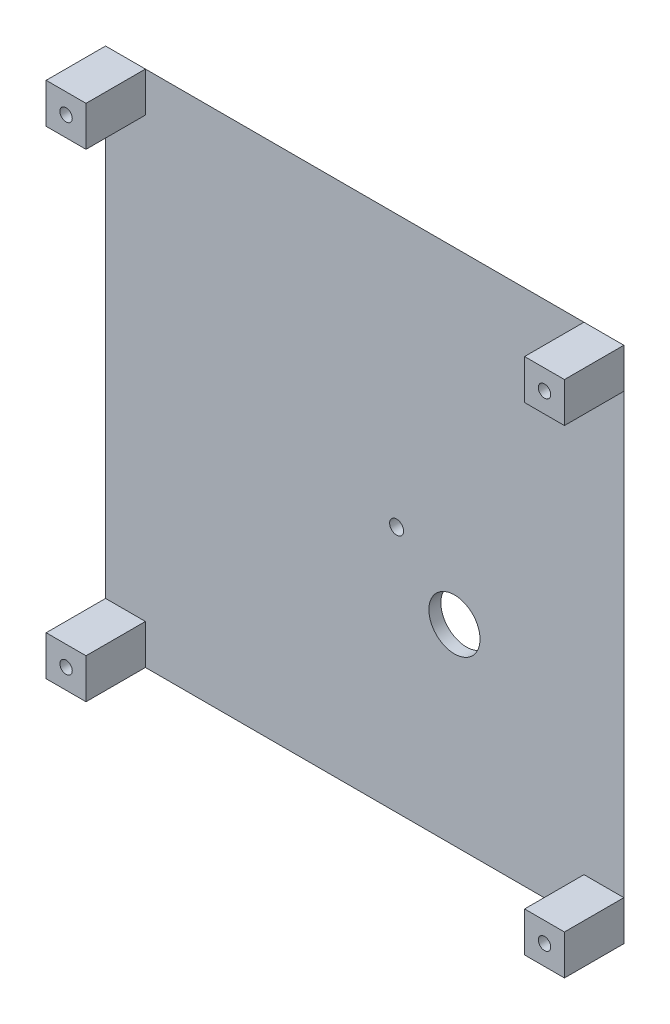
ISO-10303-21;
HEADER;
FILE_DESCRIPTION(('STEP AP214'),'2;1');
FILE_NAME('part.step','',(''),(''),'','','');
FILE_SCHEMA(('AUTOMOTIVE_DESIGN { 1 0 10303 214 1 1 1 1 }'));
ENDSEC;
DATA;
#1=APPLICATION_CONTEXT('core data for automotive mechanical design processes');
#2=APPLICATION_PROTOCOL_DEFINITION('international standard','automotive_design',2000,#1);
#3=PRODUCT_CONTEXT('',#1,'mechanical');
#4=PRODUCT('Part','Part','',(#3));
#5=PRODUCT_RELATED_PRODUCT_CATEGORY('part','',(#4));
#6=PRODUCT_DEFINITION_FORMATION('','',#4);
#7=PRODUCT_DEFINITION_CONTEXT('part definition',#1,'design');
#8=PRODUCT_DEFINITION('design','',#6,#7);
#9=PRODUCT_DEFINITION_SHAPE('','',#8);
#10=(LENGTH_UNIT() NAMED_UNIT(*) SI_UNIT(.MILLI.,.METRE.));
#11=(NAMED_UNIT(*) PLANE_ANGLE_UNIT() SI_UNIT($,.RADIAN.));
#12=(NAMED_UNIT(*) SI_UNIT($,.STERADIAN.) SOLID_ANGLE_UNIT());
#13=UNCERTAINTY_MEASURE_WITH_UNIT(LENGTH_MEASURE(1.E-05),#10,'distance_accuracy_value','');
#14=(GEOMETRIC_REPRESENTATION_CONTEXT(3) GLOBAL_UNCERTAINTY_ASSIGNED_CONTEXT((#13)) GLOBAL_UNIT_ASSIGNED_CONTEXT((#10,
#11,#12)) REPRESENTATION_CONTEXT('',''));
#15=CARTESIAN_POINT('',(0.,0.,0.));
#16=DIRECTION('',(0.,0.,1.));
#17=DIRECTION('',(1.,0.,0.));
#18=AXIS2_PLACEMENT_3D('',#15,#16,#17);
#19=CARTESIAN_POINT('',(0.,0.,3.));
#20=DIRECTION('',(0.,0.,1.));
#21=DIRECTION('',(1.,0.,0.));
#22=AXIS2_PLACEMENT_3D('',#19,#20,#21);
#23=PLANE('',#22);
#24=CARTESIAN_POINT('',(73.,62.,3.));
#25=DIRECTION('',(0.,0.,1.));
#26=DIRECTION('',(1.,0.,0.));
#27=AXIS2_PLACEMENT_3D('',#24,#25,#26);
#28=CIRCLE('',#27,1.75);
#29=CARTESIAN_POINT('',(74.75,62.,3.));
#30=VERTEX_POINT('',#29);
#31=EDGE_CURVE('E431',#30,#30,#28,.T.);
#32=ORIENTED_EDGE('',*,*,#31,.F.);
#33=EDGE_LOOP('',(#32));
#34=FACE_BOUND('',#33,.T.);
#35=CARTESIAN_POINT('',(87.513655994675,48.1147611289938,3.));
#36=DIRECTION('',(0.,0.,1.));
#37=DIRECTION('',(1.,0.,0.));
#38=AXIS2_PLACEMENT_3D('',#35,#36,#37);
#39=CIRCLE('',#38,6.41534816228666);
#40=CARTESIAN_POINT('',(93.9290041569616,48.1147611289938,3.));
#41=VERTEX_POINT('',#40);
#42=EDGE_CURVE('E421',#41,#41,#39,.T.);
#43=ORIENTED_EDGE('',*,*,#42,.F.);
#44=EDGE_LOOP('',(#43));
#45=FACE_BOUND('',#44,.T.);
#46=DIRECTION('',(-1.,0.,0.));
#47=VECTOR('',#46,1.);
#48=CARTESIAN_POINT('',(0.,10.,3.));
#49=LINE('',#48,#47);
#50=CARTESIAN_POINT('',(10.,10.,3.));
#51=VERTEX_POINT('',#50);
#52=CARTESIAN_POINT('',(0.,9.99999999999999,3.));
#53=VERTEX_POINT('',#52);
#54=EDGE_CURVE('E49',#51,#53,#49,.T.);
#55=ORIENTED_EDGE('',*,*,#54,.F.);
#56=DIRECTION('',(0.,1.,0.));
#57=VECTOR('',#56,1.);
#58=CARTESIAN_POINT('',(10.,0.,3.));
#59=LINE('',#58,#57);
#60=CARTESIAN_POINT('',(10.,0.,3.));
#61=VERTEX_POINT('',#60);
#62=EDGE_CURVE('E53',#61,#51,#59,.T.);
#63=ORIENTED_EDGE('',*,*,#62,.F.);
#64=DIRECTION('',(1.,0.,0.));
#65=VECTOR('',#64,1.);
#66=CARTESIAN_POINT('',(0.,0.,3.));
#67=LINE('',#66,#65);
#68=CARTESIAN_POINT('',(120.,0.,3.));
#69=VERTEX_POINT('',#68);
#70=EDGE_CURVE('E375',#61,#69,#67,.T.);
#71=ORIENTED_EDGE('',*,*,#70,.T.);
#72=DIRECTION('',(0.,-1.,0.));
#73=VECTOR('',#72,1.);
#74=CARTESIAN_POINT('',(120.,0.,3.));
#75=LINE('',#74,#73);
#76=CARTESIAN_POINT('',(120.,10.,3.));
#77=VERTEX_POINT('',#76);
#78=EDGE_CURVE('E205',#77,#69,#75,.T.);
#79=ORIENTED_EDGE('',*,*,#78,.F.);
#80=DIRECTION('',(-1.,0.,0.));
#81=VECTOR('',#80,1.);
#82=CARTESIAN_POINT('',(130.,10.,3.));
#83=LINE('',#82,#81);
#84=CARTESIAN_POINT('',(130.,10.,3.));
#85=VERTEX_POINT('',#84);
#86=EDGE_CURVE('E186',#85,#77,#83,.T.);
#87=ORIENTED_EDGE('',*,*,#86,.F.);
#88=DIRECTION('',(0.,1.,0.));
#89=VECTOR('',#88,1.);
#90=CARTESIAN_POINT('',(130.,130.,3.));
#91=LINE('',#90,#89);
#92=CARTESIAN_POINT('',(130.,120.,3.));
#93=VERTEX_POINT('',#92);
#94=EDGE_CURVE('E377',#85,#93,#91,.T.);
#95=ORIENTED_EDGE('',*,*,#94,.T.);
#96=DIRECTION('',(1.,0.,0.));
#97=VECTOR('',#96,1.);
#98=CARTESIAN_POINT('',(130.,120.,3.));
#99=LINE('',#98,#97);
#100=CARTESIAN_POINT('',(120.,120.,3.));
#101=VERTEX_POINT('',#100);
#102=EDGE_CURVE('E229',#101,#93,#99,.T.);
#103=ORIENTED_EDGE('',*,*,#102,.F.);
#104=DIRECTION('',(0.,-1.,0.));
#105=VECTOR('',#104,1.);
#106=CARTESIAN_POINT('',(120.,130.,3.));
#107=LINE('',#106,#105);
#108=CARTESIAN_POINT('',(120.,130.,3.));
#109=VERTEX_POINT('',#108);
#110=EDGE_CURVE('E238',#109,#101,#107,.T.);
#111=ORIENTED_EDGE('',*,*,#110,.F.);
#112=DIRECTION('',(-1.,0.,0.));
#113=VECTOR('',#112,1.);
#114=CARTESIAN_POINT('',(0.,130.,3.));
#115=LINE('',#114,#113);
#116=CARTESIAN_POINT('',(10.,130.,3.));
#117=VERTEX_POINT('',#116);
#118=EDGE_CURVE('E288',#109,#117,#115,.T.);
#119=ORIENTED_EDGE('',*,*,#118,.T.);
#120=DIRECTION('',(0.,1.,0.));
#121=VECTOR('',#120,1.);
#122=CARTESIAN_POINT('',(10.,130.,3.));
#123=LINE('',#122,#121);
#124=CARTESIAN_POINT('',(10.,120.,3.));
#125=VERTEX_POINT('',#124);
#126=EDGE_CURVE('E276',#125,#117,#123,.T.);
#127=ORIENTED_EDGE('',*,*,#126,.F.);
#128=DIRECTION('',(1.,0.,0.));
#129=VECTOR('',#128,1.);
#130=CARTESIAN_POINT('',(0.,120.,3.));
#131=LINE('',#130,#129);
#132=CARTESIAN_POINT('',(0.,120.,3.));
#133=VERTEX_POINT('',#132);
#134=EDGE_CURVE('E258',#133,#125,#131,.T.);
#135=ORIENTED_EDGE('',*,*,#134,.F.);
#136=DIRECTION('',(0.,-1.,0.));
#137=VECTOR('',#136,1.);
#138=CARTESIAN_POINT('',(0.,130.,3.));
#139=LINE('',#138,#137);
#140=EDGE_CURVE('E348',#133,#53,#139,.T.);
#141=ORIENTED_EDGE('',*,*,#140,.T.);
#142=EDGE_LOOP('',(#55,#63,#71,#79,#87,#95,#103,#111,#119,#127,#135,#141));
#143=FACE_BOUND('',#142,.T.);
#144=ADVANCED_FACE('F32',(#34,#45,#143),#23,.T.);
#145=CARTESIAN_POINT('',(0.,0.,0.));
#146=DIRECTION('',(0.,0.,1.));
#147=DIRECTION('',(1.,0.,0.));
#148=AXIS2_PLACEMENT_3D('',#145,#146,#147);
#149=PLANE('',#148);
#150=CARTESIAN_POINT('',(73.,62.,0.));
#151=DIRECTION('',(0.,0.,1.));
#152=DIRECTION('',(1.,0.,0.));
#153=AXIS2_PLACEMENT_3D('',#150,#151,#152);
#154=CIRCLE('',#153,1.75);
#155=CARTESIAN_POINT('',(74.75,62.,0.));
#156=VERTEX_POINT('',#155);
#157=EDGE_CURVE('E36',#156,#156,#154,.T.);
#158=ORIENTED_EDGE('',*,*,#157,.T.);
#159=EDGE_LOOP('',(#158));
#160=FACE_BOUND('',#159,.T.);
#161=CARTESIAN_POINT('',(87.513655994675,48.1147611289938,0.));
#162=DIRECTION('',(0.,0.,1.));
#163=DIRECTION('',(1.,0.,0.));
#164=AXIS2_PLACEMENT_3D('',#161,#162,#163);
#165=CIRCLE('',#164,6.41534816228666);
#166=CARTESIAN_POINT('',(93.9290041569616,48.1147611289938,0.));
#167=VERTEX_POINT('',#166);
#168=EDGE_CURVE('E418',#167,#167,#165,.T.);
#169=ORIENTED_EDGE('',*,*,#168,.T.);
#170=EDGE_LOOP('',(#169));
#171=FACE_BOUND('',#170,.T.);
#172=DIRECTION('',(0.,1.,0.));
#173=VECTOR('',#172,1.);
#174=CARTESIAN_POINT('',(3.,0.,0.));
#175=LINE('',#174,#173);
#176=CARTESIAN_POINT('',(3.,3.,0.));
#177=VERTEX_POINT('',#176);
#178=CARTESIAN_POINT('',(3.,127.,0.));
#179=VERTEX_POINT('',#178);
#180=EDGE_CURVE('E299',#177,#179,#175,.T.);
#181=ORIENTED_EDGE('',*,*,#180,.T.);
#182=DIRECTION('',(1.,0.,0.));
#183=VECTOR('',#182,1.);
#184=CARTESIAN_POINT('',(0.,127.,0.));
#185=LINE('',#184,#183);
#186=CARTESIAN_POINT('',(127.,127.,0.));
#187=VERTEX_POINT('',#186);
#188=EDGE_CURVE('E358',#179,#187,#185,.T.);
#189=ORIENTED_EDGE('',*,*,#188,.T.);
#190=DIRECTION('',(0.,-1.,0.));
#191=VECTOR('',#190,1.);
#192=CARTESIAN_POINT('',(127.,0.,0.));
#193=LINE('',#192,#191);
#194=CARTESIAN_POINT('',(127.,3.,0.));
#195=VERTEX_POINT('',#194);
#196=EDGE_CURVE('E361',#187,#195,#193,.T.);
#197=ORIENTED_EDGE('',*,*,#196,.T.);
#198=DIRECTION('',(-1.,0.,0.));
#199=VECTOR('',#198,1.);
#200=CARTESIAN_POINT('',(0.,3.,0.));
#201=LINE('',#200,#199);
#202=EDGE_CURVE('E362',#195,#177,#201,.T.);
#203=ORIENTED_EDGE('',*,*,#202,.T.);
#204=EDGE_LOOP('',(#181,#189,#197,#203));
#205=FACE_BOUND('',#204,.T.);
#206=ADVANCED_FACE('F368',(#160,#171,#205),#149,.F.);
#207=CARTESIAN_POINT('',(0.,0.,2.99999999999998));
#208=DIRECTION('',(0.,0.707106781186544,0.707106781186551));
#209=DIRECTION('',(1.,0.,0.));
#210=AXIS2_PLACEMENT_3D('',#207,#208,#209);
#211=PLANE('',#210);
#212=DIRECTION('',(-0.577350269189628,-0.577350269189628,0.577350269189622));
#213=VECTOR('',#212,1.);
#214=CARTESIAN_POINT('',(43.3333333333336,43.3333333333336,-40.3333333333332));
#215=LINE('',#214,#213);
#216=CARTESIAN_POINT('',(0.,0.,3.));
#217=VERTEX_POINT('',#216);
#218=EDGE_CURVE('E353',#177,#217,#215,.T.);
#219=ORIENTED_EDGE('',*,*,#218,.F.);
#220=ORIENTED_EDGE('',*,*,#202,.F.);
#221=DIRECTION('',(0.577350269189631,-0.577350269189626,0.57735026918962));
#222=VECTOR('',#221,1.);
#223=CARTESIAN_POINT('',(86.6666666666658,43.3333333333337,-40.3333333333333));
#224=LINE('',#223,#222);
#225=CARTESIAN_POINT('',(130.,0.,3.));
#226=VERTEX_POINT('',#225);
#227=EDGE_CURVE('E350',#226,#195,#224,.F.);
#228=ORIENTED_EDGE('',*,*,#227,.F.);
#229=DIRECTION('',(1.,0.,0.));
#230=VECTOR('',#229,1.);
#231=CARTESIAN_POINT('',(130.,0.,3.));
#232=LINE('',#231,#230);
#233=EDGE_CURVE('E196',#69,#226,#232,.T.);
#234=ORIENTED_EDGE('',*,*,#233,.F.);
#235=ORIENTED_EDGE('',*,*,#70,.F.);
#236=EDGE_CURVE('E346',#217,#61,#67,.T.);
#237=ORIENTED_EDGE('',*,*,#236,.F.);
#238=EDGE_LOOP('',(#219,#220,#228,#234,#235,#237));
#239=FACE_BOUND('',#238,.T.);
#240=ADVANCED_FACE('F34',(#239),#211,.F.);
#241=CARTESIAN_POINT('',(130.,130.,2.99999999999998));
#242=DIRECTION('',(-0.707106781186541,0.,0.707106781186554));
#243=DIRECTION('',(0.,1.,0.));
#244=AXIS2_PLACEMENT_3D('',#241,#242,#243);
#245=PLANE('',#244);
#246=ORIENTED_EDGE('',*,*,#227,.T.);
#247=ORIENTED_EDGE('',*,*,#196,.F.);
#248=DIRECTION('',(0.577350269189631,0.577350269189626,0.577350269189621));
#249=VECTOR('',#248,1.);
#250=CARTESIAN_POINT('',(130.,130.,2.99999999999998));
#251=LINE('',#250,#249);
#252=CARTESIAN_POINT('',(130.,130.,3.));
#253=VERTEX_POINT('',#252);
#254=EDGE_CURVE('E355',#253,#187,#251,.F.);
#255=ORIENTED_EDGE('',*,*,#254,.F.);
#256=DIRECTION('',(0.,1.,0.));
#257=VECTOR('',#256,1.);
#258=CARTESIAN_POINT('',(130.,130.,3.));
#259=LINE('',#258,#257);
#260=EDGE_CURVE('E224',#93,#253,#259,.T.);
#261=ORIENTED_EDGE('',*,*,#260,.F.);
#262=ORIENTED_EDGE('',*,*,#94,.F.);
#263=EDGE_CURVE('E292',#226,#85,#91,.T.);
#264=ORIENTED_EDGE('',*,*,#263,.F.);
#265=EDGE_LOOP('',(#246,#247,#255,#261,#262,#264));
#266=FACE_BOUND('',#265,.T.);
#267=ADVANCED_FACE('F389',(#266),#245,.F.);
#268=CARTESIAN_POINT('',(0.,130.,2.99999999999998));
#269=DIRECTION('',(0.707106781186544,0.,0.707106781186551));
#270=DIRECTION('',(0.,-1.,0.));
#271=AXIS2_PLACEMENT_3D('',#268,#269,#270);
#272=PLANE('',#271);
#273=ORIENTED_EDGE('',*,*,#218,.T.);
#274=DIRECTION('',(0.,-1.,0.));
#275=VECTOR('',#274,1.);
#276=CARTESIAN_POINT('',(0.,0.,3.));
#277=LINE('',#276,#275);
#278=EDGE_CURVE('E182',#53,#217,#277,.T.);
#279=ORIENTED_EDGE('',*,*,#278,.F.);
#280=ORIENTED_EDGE('',*,*,#140,.F.);
#281=CARTESIAN_POINT('',(0.,130.,3.));
#282=VERTEX_POINT('',#281);
#283=EDGE_CURVE('E306',#282,#133,#139,.T.);
#284=ORIENTED_EDGE('',*,*,#283,.F.);
#285=DIRECTION('',(0.577350269189628,-0.577350269189628,-0.577350269189622));
#286=VECTOR('',#285,1.);
#287=CARTESIAN_POINT('',(0.,130.,2.99999999999998));
#288=LINE('',#287,#286);
#289=EDGE_CURVE('E316',#179,#282,#288,.F.);
#290=ORIENTED_EDGE('',*,*,#289,.F.);
#291=ORIENTED_EDGE('',*,*,#180,.F.);
#292=EDGE_LOOP('',(#273,#279,#280,#284,#290,#291));
#293=FACE_BOUND('',#292,.T.);
#294=ADVANCED_FACE('F374',(#293),#272,.F.);
#295=CARTESIAN_POINT('',(0.,130.,2.99999999999998));
#296=DIRECTION('',(0.,-0.707106781186544,0.707106781186551));
#297=DIRECTION('',(-1.,0.,0.));
#298=AXIS2_PLACEMENT_3D('',#295,#296,#297);
#299=PLANE('',#298);
#300=ORIENTED_EDGE('',*,*,#254,.T.);
#301=ORIENTED_EDGE('',*,*,#188,.F.);
#302=ORIENTED_EDGE('',*,*,#289,.T.);
#303=DIRECTION('',(-1.,0.,0.));
#304=VECTOR('',#303,1.);
#305=CARTESIAN_POINT('',(0.,130.,3.));
#306=LINE('',#305,#304);
#307=EDGE_CURVE('E265',#117,#282,#306,.T.);
#308=ORIENTED_EDGE('',*,*,#307,.F.);
#309=ORIENTED_EDGE('',*,*,#118,.F.);
#310=EDGE_CURVE('E291',#253,#109,#115,.T.);
#311=ORIENTED_EDGE('',*,*,#310,.F.);
#312=EDGE_LOOP('',(#300,#301,#302,#308,#309,#311));
#313=FACE_BOUND('',#312,.T.);
#314=ADVANCED_FACE('F371',(#313),#299,.F.);
#315=CARTESIAN_POINT('',(0.,0.,17.9));
#316=DIRECTION('',(0.,0.,1.));
#317=DIRECTION('',(1.,0.,0.));
#318=AXIS2_PLACEMENT_3D('',#315,#316,#317);
#319=PLANE('',#318);
#320=DIRECTION('',(0.,-1.,0.));
#321=VECTOR('',#320,1.);
#322=CARTESIAN_POINT('',(0.,130.,17.9));
#323=LINE('',#322,#321);
#324=CARTESIAN_POINT('',(0.,130.,17.9));
#325=VERTEX_POINT('',#324);
#326=CARTESIAN_POINT('',(0.,120.,17.9));
#327=VERTEX_POINT('',#326);
#328=EDGE_CURVE('E261',#325,#327,#323,.T.);
#329=ORIENTED_EDGE('',*,*,#328,.T.);
#330=DIRECTION('',(1.,0.,0.));
#331=VECTOR('',#330,1.);
#332=CARTESIAN_POINT('',(0.,120.,17.9));
#333=LINE('',#332,#331);
#334=CARTESIAN_POINT('',(10.,120.,17.9));
#335=VERTEX_POINT('',#334);
#336=EDGE_CURVE('E264',#327,#335,#333,.T.);
#337=ORIENTED_EDGE('',*,*,#336,.T.);
#338=DIRECTION('',(0.,1.,0.));
#339=VECTOR('',#338,1.);
#340=CARTESIAN_POINT('',(10.,130.,17.9));
#341=LINE('',#340,#339);
#342=CARTESIAN_POINT('',(10.,130.,17.9));
#343=VERTEX_POINT('',#342);
#344=EDGE_CURVE('E267',#335,#343,#341,.T.);
#345=ORIENTED_EDGE('',*,*,#344,.T.);
#346=DIRECTION('',(-1.,0.,0.));
#347=VECTOR('',#346,1.);
#348=CARTESIAN_POINT('',(0.,130.,17.9));
#349=LINE('',#348,#347);
#350=EDGE_CURVE('E269',#343,#325,#349,.T.);
#351=ORIENTED_EDGE('',*,*,#350,.T.);
#352=EDGE_LOOP('',(#329,#337,#345,#351));
#353=FACE_BOUND('',#352,.T.);
#354=CARTESIAN_POINT('',(5.,125.,17.9));
#355=DIRECTION('',(0.,0.,1.));
#356=DIRECTION('',(1.,0.,0.));
#357=AXIS2_PLACEMENT_3D('',#354,#355,#356);
#358=CIRCLE('',#357,1.55);
#359=CARTESIAN_POINT('',(6.55,125.,17.9));
#360=VERTEX_POINT('',#359);
#361=EDGE_CURVE('E255',#360,#360,#358,.T.);
#362=ORIENTED_EDGE('',*,*,#361,.F.);
#363=EDGE_LOOP('',(#362));
#364=FACE_BOUND('',#363,.T.);
#365=ADVANCED_FACE('F334',(#353,#364),#319,.T.);
#366=CARTESIAN_POINT('',(0.,130.,17.9));
#367=DIRECTION('',(1.,0.,0.));
#368=DIRECTION('',(0.,1.,0.));
#369=AXIS2_PLACEMENT_3D('',#366,#367,#368);
#370=PLANE('',#369);
#371=ORIENTED_EDGE('',*,*,#283,.T.);
#372=DIRECTION('',(0.,0.,-1.));
#373=VECTOR('',#372,1.);
#374=CARTESIAN_POINT('',(0.,120.,17.9));
#375=LINE('',#374,#373);
#376=EDGE_CURVE('E313',#327,#133,#375,.T.);
#377=ORIENTED_EDGE('',*,*,#376,.F.);
#378=ORIENTED_EDGE('',*,*,#328,.F.);
#379=DIRECTION('',(0.,0.,-1.));
#380=VECTOR('',#379,1.);
#381=CARTESIAN_POINT('',(0.,130.,17.9));
#382=LINE('',#381,#380);
#383=EDGE_CURVE('E271',#325,#282,#382,.T.);
#384=ORIENTED_EDGE('',*,*,#383,.T.);
#385=EDGE_LOOP('',(#371,#377,#378,#384));
#386=FACE_BOUND('',#385,.T.);
#387=ADVANCED_FACE('F330',(#386),#370,.F.);
#388=CARTESIAN_POINT('',(0.,120.,17.9));
#389=DIRECTION('',(0.,1.,0.));
#390=DIRECTION('',(-1.,0.,0.));
#391=AXIS2_PLACEMENT_3D('',#388,#389,#390);
#392=PLANE('',#391);
#393=ORIENTED_EDGE('',*,*,#134,.T.);
#394=DIRECTION('',(0.,0.,-1.));
#395=VECTOR('',#394,1.);
#396=CARTESIAN_POINT('',(10.,120.,17.9));
#397=LINE('',#396,#395);
#398=EDGE_CURVE('E285',#335,#125,#397,.T.);
#399=ORIENTED_EDGE('',*,*,#398,.F.);
#400=ORIENTED_EDGE('',*,*,#336,.F.);
#401=ORIENTED_EDGE('',*,*,#376,.T.);
#402=EDGE_LOOP('',(#393,#399,#400,#401));
#403=FACE_BOUND('',#402,.T.);
#404=ADVANCED_FACE('F344',(#403),#392,.F.);
#405=CARTESIAN_POINT('',(10.,130.,17.9));
#406=DIRECTION('',(-1.,0.,0.));
#407=DIRECTION('',(0.,-1.,0.));
#408=AXIS2_PLACEMENT_3D('',#405,#406,#407);
#409=PLANE('',#408);
#410=ORIENTED_EDGE('',*,*,#126,.T.);
#411=DIRECTION('',(0.,0.,-1.));
#412=VECTOR('',#411,1.);
#413=CARTESIAN_POINT('',(10.,130.,17.9));
#414=LINE('',#413,#412);
#415=EDGE_CURVE('E282',#343,#117,#414,.T.);
#416=ORIENTED_EDGE('',*,*,#415,.F.);
#417=ORIENTED_EDGE('',*,*,#344,.F.);
#418=ORIENTED_EDGE('',*,*,#398,.T.);
#419=EDGE_LOOP('',(#410,#416,#417,#418));
#420=FACE_BOUND('',#419,.T.);
#421=ADVANCED_FACE('F340',(#420),#409,.F.);
#422=CARTESIAN_POINT('',(0.,130.,17.9));
#423=DIRECTION('',(0.,-1.,0.));
#424=DIRECTION('',(0.,0.,-1.));
#425=AXIS2_PLACEMENT_3D('',#422,#423,#424);
#426=PLANE('',#425);
#427=ORIENTED_EDGE('',*,*,#307,.T.);
#428=ORIENTED_EDGE('',*,*,#383,.F.);
#429=ORIENTED_EDGE('',*,*,#350,.F.);
#430=ORIENTED_EDGE('',*,*,#415,.T.);
#431=EDGE_LOOP('',(#427,#428,#429,#430));
#432=FACE_BOUND('',#431,.T.);
#433=ADVANCED_FACE('F323',(#432),#426,.F.);
#434=CARTESIAN_POINT('',(5.,125.,17.9));
#435=DIRECTION('',(0.,0.,-1.));
#436=DIRECTION('',(-1.,0.,0.));
#437=AXIS2_PLACEMENT_3D('',#434,#435,#436);
#438=CYLINDRICAL_SURFACE('',#437,1.55);
#439=ORIENTED_EDGE('',*,*,#361,.T.);
#440=EDGE_LOOP('',(#439));
#441=FACE_BOUND('',#440,.T.);
#442=CARTESIAN_POINT('',(5.,125.,3.));
#443=DIRECTION('',(0.,0.,1.));
#444=DIRECTION('',(1.,0.,0.));
#445=AXIS2_PLACEMENT_3D('',#442,#443,#444);
#446=CIRCLE('',#445,1.55);
#447=CARTESIAN_POINT('',(6.55,125.,3.));
#448=VERTEX_POINT('',#447);
#449=EDGE_CURVE('E254',#448,#448,#446,.T.);
#450=ORIENTED_EDGE('',*,*,#449,.F.);
#451=EDGE_LOOP('',(#450));
#452=FACE_BOUND('',#451,.T.);
#453=ADVANCED_FACE('F483',(#441,#452),#438,.F.);
#454=ORIENTED_EDGE('',*,*,#449,.T.);
#455=EDGE_LOOP('',(#454));
#456=FACE_BOUND('',#455,.T.);
#457=ADVANCED_FACE('F473',(#456),#23,.T.);
#458=CARTESIAN_POINT('',(0.,0.,17.9));
#459=DIRECTION('',(0.,0.,-1.));
#460=DIRECTION('',(-1.,0.,0.));
#461=AXIS2_PLACEMENT_3D('',#458,#459,#460);
#462=PLANE('',#461);
#463=DIRECTION('',(0.,1.,0.));
#464=VECTOR('',#463,1.);
#465=CARTESIAN_POINT('',(130.,130.,17.9));
#466=LINE('',#465,#464);
#467=CARTESIAN_POINT('',(130.,120.,17.9));
#468=VERTEX_POINT('',#467);
#469=CARTESIAN_POINT('',(130.,130.,17.9));
#470=VERTEX_POINT('',#469);
#471=EDGE_CURVE('E225',#468,#470,#466,.T.);
#472=ORIENTED_EDGE('',*,*,#471,.T.);
#473=DIRECTION('',(-1.,0.,0.));
#474=VECTOR('',#473,1.);
#475=CARTESIAN_POINT('',(130.,130.,17.9));
#476=LINE('',#475,#474);
#477=CARTESIAN_POINT('',(120.,130.,17.9));
#478=VERTEX_POINT('',#477);
#479=EDGE_CURVE('E228',#470,#478,#476,.T.);
#480=ORIENTED_EDGE('',*,*,#479,.T.);
#481=DIRECTION('',(0.,-1.,0.));
#482=VECTOR('',#481,1.);
#483=CARTESIAN_POINT('',(120.,130.,17.9));
#484=LINE('',#483,#482);
#485=CARTESIAN_POINT('',(120.,120.,17.9));
#486=VERTEX_POINT('',#485);
#487=EDGE_CURVE('E231',#478,#486,#484,.T.);
#488=ORIENTED_EDGE('',*,*,#487,.T.);
#489=DIRECTION('',(1.,0.,0.));
#490=VECTOR('',#489,1.);
#491=CARTESIAN_POINT('',(130.,120.,17.9));
#492=LINE('',#491,#490);
#493=EDGE_CURVE('E233',#486,#468,#492,.T.);
#494=ORIENTED_EDGE('',*,*,#493,.T.);
#495=EDGE_LOOP('',(#472,#480,#488,#494));
#496=FACE_BOUND('',#495,.T.);
#497=CARTESIAN_POINT('',(125.,125.,17.9));
#498=DIRECTION('',(0.,0.,1.));
#499=DIRECTION('',(1.,0.,0.));
#500=AXIS2_PLACEMENT_3D('',#497,#498,#499);
#501=CIRCLE('',#500,1.54999999999999);
#502=CARTESIAN_POINT('',(126.55,125.,17.9));
#503=VERTEX_POINT('',#502);
#504=EDGE_CURVE('E221',#503,#503,#501,.T.);
#505=ORIENTED_EDGE('',*,*,#504,.F.);
#506=EDGE_LOOP('',(#505));
#507=FACE_BOUND('',#506,.T.);
#508=ADVANCED_FACE('F482',(#496,#507),#462,.F.);
#509=CARTESIAN_POINT('',(130.,130.,17.9));
#510=DIRECTION('',(-1.,0.,0.));
#511=DIRECTION('',(0.,0.,1.));
#512=AXIS2_PLACEMENT_3D('',#509,#510,#511);
#513=PLANE('',#512);
#514=ORIENTED_EDGE('',*,*,#260,.T.);
#515=DIRECTION('',(0.,0.,-1.));
#516=VECTOR('',#515,1.);
#517=CARTESIAN_POINT('',(130.,130.,17.9));
#518=LINE('',#517,#516);
#519=EDGE_CURVE('E251',#470,#253,#518,.T.);
#520=ORIENTED_EDGE('',*,*,#519,.F.);
#521=ORIENTED_EDGE('',*,*,#471,.F.);
#522=DIRECTION('',(0.,0.,-1.));
#523=VECTOR('',#522,1.);
#524=CARTESIAN_POINT('',(130.,120.,17.9));
#525=LINE('',#524,#523);
#526=EDGE_CURVE('E235',#468,#93,#525,.T.);
#527=ORIENTED_EDGE('',*,*,#526,.T.);
#528=EDGE_LOOP('',(#514,#520,#521,#527));
#529=FACE_BOUND('',#528,.T.);
#530=ADVANCED_FACE('F489',(#529),#513,.F.);
#531=CARTESIAN_POINT('',(130.,130.,17.9));
#532=DIRECTION('',(0.,-1.,0.));
#533=DIRECTION('',(0.,0.,-1.));
#534=AXIS2_PLACEMENT_3D('',#531,#532,#533);
#535=PLANE('',#534);
#536=ORIENTED_EDGE('',*,*,#310,.T.);
#537=DIRECTION('',(0.,0.,-1.));
#538=VECTOR('',#537,1.);
#539=CARTESIAN_POINT('',(120.,130.,17.9));
#540=LINE('',#539,#538);
#541=EDGE_CURVE('E248',#478,#109,#540,.T.);
#542=ORIENTED_EDGE('',*,*,#541,.F.);
#543=ORIENTED_EDGE('',*,*,#479,.F.);
#544=ORIENTED_EDGE('',*,*,#519,.T.);
#545=EDGE_LOOP('',(#536,#542,#543,#544));
#546=FACE_BOUND('',#545,.T.);
#547=ADVANCED_FACE('F633',(#546),#535,.F.);
#548=CARTESIAN_POINT('',(120.,130.,17.9));
#549=DIRECTION('',(1.,0.,0.));
#550=DIRECTION('',(0.,0.,-1.));
#551=AXIS2_PLACEMENT_3D('',#548,#549,#550);
#552=PLANE('',#551);
#553=ORIENTED_EDGE('',*,*,#110,.T.);
#554=DIRECTION('',(0.,0.,-1.));
#555=VECTOR('',#554,1.);
#556=CARTESIAN_POINT('',(120.,120.,17.9));
#557=LINE('',#556,#555);
#558=EDGE_CURVE('E245',#486,#101,#557,.T.);
#559=ORIENTED_EDGE('',*,*,#558,.F.);
#560=ORIENTED_EDGE('',*,*,#487,.F.);
#561=ORIENTED_EDGE('',*,*,#541,.T.);
#562=EDGE_LOOP('',(#553,#559,#560,#561));
#563=FACE_BOUND('',#562,.T.);
#564=ADVANCED_FACE('F623',(#563),#552,.F.);
#565=CARTESIAN_POINT('',(130.,120.,17.9));
#566=DIRECTION('',(0.,1.,0.));
#567=DIRECTION('',(0.,0.,1.));
#568=AXIS2_PLACEMENT_3D('',#565,#566,#567);
#569=PLANE('',#568);
#570=ORIENTED_EDGE('',*,*,#102,.T.);
#571=ORIENTED_EDGE('',*,*,#526,.F.);
#572=ORIENTED_EDGE('',*,*,#493,.F.);
#573=ORIENTED_EDGE('',*,*,#558,.T.);
#574=EDGE_LOOP('',(#570,#571,#572,#573));
#575=FACE_BOUND('',#574,.T.);
#576=ADVANCED_FACE('F477',(#575),#569,.F.);
#577=CARTESIAN_POINT('',(125.,125.,17.9));
#578=DIRECTION('',(0.,0.,-1.));
#579=DIRECTION('',(-1.,0.,0.));
#580=AXIS2_PLACEMENT_3D('',#577,#578,#579);
#581=CYLINDRICAL_SURFACE('',#580,1.54999999999999);
#582=ORIENTED_EDGE('',*,*,#504,.T.);
#583=EDGE_LOOP('',(#582));
#584=FACE_BOUND('',#583,.T.);
#585=CARTESIAN_POINT('',(125.,125.,3.));
#586=DIRECTION('',(0.,0.,1.));
#587=DIRECTION('',(1.,0.,0.));
#588=AXIS2_PLACEMENT_3D('',#585,#586,#587);
#589=CIRCLE('',#588,1.54999999999999);
#590=CARTESIAN_POINT('',(126.55,125.,3.));
#591=VERTEX_POINT('',#590);
#592=EDGE_CURVE('E293',#591,#591,#589,.F.);
#593=ORIENTED_EDGE('',*,*,#592,.T.);
#594=EDGE_LOOP('',(#593));
#595=FACE_BOUND('',#594,.T.);
#596=ADVANCED_FACE('F471',(#584,#595),#581,.F.);
#597=ORIENTED_EDGE('',*,*,#592,.F.);
#598=EDGE_LOOP('',(#597));
#599=FACE_BOUND('',#598,.T.);
#600=ADVANCED_FACE('F405',(#599),#23,.T.);
#601=CARTESIAN_POINT('',(0.,0.,17.9));
#602=DIRECTION('',(0.,0.,1.));
#603=DIRECTION('',(1.,0.,0.));
#604=AXIS2_PLACEMENT_3D('',#601,#602,#603);
#605=PLANE('',#604);
#606=DIRECTION('',(0.,1.,0.));
#607=VECTOR('',#606,1.);
#608=CARTESIAN_POINT('',(130.,0.,17.9));
#609=LINE('',#608,#607);
#610=CARTESIAN_POINT('',(130.,0.,17.9));
#611=VERTEX_POINT('',#610);
#612=CARTESIAN_POINT('',(130.,10.,17.9));
#613=VERTEX_POINT('',#612);
#614=EDGE_CURVE('E192',#611,#613,#609,.T.);
#615=ORIENTED_EDGE('',*,*,#614,.T.);
#616=DIRECTION('',(-1.,0.,0.));
#617=VECTOR('',#616,1.);
#618=CARTESIAN_POINT('',(130.,10.,17.9));
#619=LINE('',#618,#617);
#620=CARTESIAN_POINT('',(120.,10.,17.9));
#621=VERTEX_POINT('',#620);
#622=EDGE_CURVE('E195',#613,#621,#619,.T.);
#623=ORIENTED_EDGE('',*,*,#622,.T.);
#624=DIRECTION('',(0.,-1.,0.));
#625=VECTOR('',#624,1.);
#626=CARTESIAN_POINT('',(120.,0.,17.9));
#627=LINE('',#626,#625);
#628=CARTESIAN_POINT('',(120.,0.,17.9));
#629=VERTEX_POINT('',#628);
#630=EDGE_CURVE('E198',#621,#629,#627,.T.);
#631=ORIENTED_EDGE('',*,*,#630,.T.);
#632=DIRECTION('',(1.,0.,0.));
#633=VECTOR('',#632,1.);
#634=CARTESIAN_POINT('',(130.,0.,17.9));
#635=LINE('',#634,#633);
#636=EDGE_CURVE('E200',#629,#611,#635,.T.);
#637=ORIENTED_EDGE('',*,*,#636,.T.);
#638=EDGE_LOOP('',(#615,#623,#631,#637));
#639=FACE_BOUND('',#638,.T.);
#640=CARTESIAN_POINT('',(125.,5.,17.9));
#641=DIRECTION('',(0.,0.,1.));
#642=DIRECTION('',(1.,0.,0.));
#643=AXIS2_PLACEMENT_3D('',#640,#641,#642);
#644=CIRCLE('',#643,1.54999999999999);
#645=CARTESIAN_POINT('',(126.55,5.,17.9));
#646=VERTEX_POINT('',#645);
#647=EDGE_CURVE('E183',#646,#646,#644,.T.);
#648=ORIENTED_EDGE('',*,*,#647,.F.);
#649=EDGE_LOOP('',(#648));
#650=FACE_BOUND('',#649,.T.);
#651=ADVANCED_FACE('F402',(#639,#650),#605,.T.);
#652=CARTESIAN_POINT('',(130.,0.,17.9));
#653=DIRECTION('',(-1.,0.,0.));
#654=DIRECTION('',(0.,0.,1.));
#655=AXIS2_PLACEMENT_3D('',#652,#653,#654);
#656=PLANE('',#655);
#657=ORIENTED_EDGE('',*,*,#263,.T.);
#658=DIRECTION('',(0.,0.,-1.));
#659=VECTOR('',#658,1.);
#660=CARTESIAN_POINT('',(130.,10.,17.9));
#661=LINE('',#660,#659);
#662=EDGE_CURVE('E218',#613,#85,#661,.T.);
#663=ORIENTED_EDGE('',*,*,#662,.F.);
#664=ORIENTED_EDGE('',*,*,#614,.F.);
#665=DIRECTION('',(0.,0.,-1.));
#666=VECTOR('',#665,1.);
#667=CARTESIAN_POINT('',(130.,0.,17.9));
#668=LINE('',#667,#666);
#669=EDGE_CURVE('E202',#611,#226,#668,.T.);
#670=ORIENTED_EDGE('',*,*,#669,.T.);
#671=EDGE_LOOP('',(#657,#663,#664,#670));
#672=FACE_BOUND('',#671,.T.);
#673=ADVANCED_FACE('F385',(#672),#656,.F.);
#674=CARTESIAN_POINT('',(130.,10.,17.9));
#675=DIRECTION('',(0.,-1.,0.));
#676=DIRECTION('',(0.,0.,-1.));
#677=AXIS2_PLACEMENT_3D('',#674,#675,#676);
#678=PLANE('',#677);
#679=ORIENTED_EDGE('',*,*,#86,.T.);
#680=DIRECTION('',(0.,0.,-1.));
#681=VECTOR('',#680,1.);
#682=CARTESIAN_POINT('',(120.,10.,17.9));
#683=LINE('',#682,#681);
#684=EDGE_CURVE('E215',#621,#77,#683,.T.);
#685=ORIENTED_EDGE('',*,*,#684,.F.);
#686=ORIENTED_EDGE('',*,*,#622,.F.);
#687=ORIENTED_EDGE('',*,*,#662,.T.);
#688=EDGE_LOOP('',(#679,#685,#686,#687));
#689=FACE_BOUND('',#688,.T.);
#690=ADVANCED_FACE('F400',(#689),#678,.F.);
#691=CARTESIAN_POINT('',(120.,0.,17.9));
#692=DIRECTION('',(1.,0.,0.));
#693=DIRECTION('',(0.,0.,-1.));
#694=AXIS2_PLACEMENT_3D('',#691,#692,#693);
#695=PLANE('',#694);
#696=ORIENTED_EDGE('',*,*,#78,.T.);
#697=DIRECTION('',(0.,0.,-1.));
#698=VECTOR('',#697,1.);
#699=CARTESIAN_POINT('',(120.,0.,17.9));
#700=LINE('',#699,#698);
#701=EDGE_CURVE('E212',#629,#69,#700,.T.);
#702=ORIENTED_EDGE('',*,*,#701,.F.);
#703=ORIENTED_EDGE('',*,*,#630,.F.);
#704=ORIENTED_EDGE('',*,*,#684,.T.);
#705=EDGE_LOOP('',(#696,#702,#703,#704));
#706=FACE_BOUND('',#705,.T.);
#707=ADVANCED_FACE('F396',(#706),#695,.F.);
#708=CARTESIAN_POINT('',(130.,0.,17.9));
#709=DIRECTION('',(0.,1.,0.));
#710=DIRECTION('',(-1.,0.,0.));
#711=AXIS2_PLACEMENT_3D('',#708,#709,#710);
#712=PLANE('',#711);
#713=ORIENTED_EDGE('',*,*,#233,.T.);
#714=ORIENTED_EDGE('',*,*,#669,.F.);
#715=ORIENTED_EDGE('',*,*,#636,.F.);
#716=ORIENTED_EDGE('',*,*,#701,.T.);
#717=EDGE_LOOP('',(#713,#714,#715,#716));
#718=FACE_BOUND('',#717,.T.);
#719=ADVANCED_FACE('F391',(#718),#712,.F.);
#720=CARTESIAN_POINT('',(125.,5.,17.9));
#721=DIRECTION('',(0.,0.,-1.));
#722=DIRECTION('',(-1.,0.,0.));
#723=AXIS2_PLACEMENT_3D('',#720,#721,#722);
#724=CYLINDRICAL_SURFACE('',#723,1.54999999999999);
#725=ORIENTED_EDGE('',*,*,#647,.T.);
#726=EDGE_LOOP('',(#725));
#727=FACE_BOUND('',#726,.T.);
#728=CARTESIAN_POINT('',(125.,5.,3.));
#729=DIRECTION('',(0.,0.,1.));
#730=DIRECTION('',(1.,0.,0.));
#731=AXIS2_PLACEMENT_3D('',#728,#729,#730);
#732=CIRCLE('',#731,1.54999999999999);
#733=CARTESIAN_POINT('',(126.55,5.,3.));
#734=VERTEX_POINT('',#733);
#735=EDGE_CURVE('E41',#734,#734,#732,.F.);
#736=ORIENTED_EDGE('',*,*,#735,.T.);
#737=EDGE_LOOP('',(#736));
#738=FACE_BOUND('',#737,.T.);
#739=ADVANCED_FACE('F409',(#727,#738),#724,.F.);
#740=ORIENTED_EDGE('',*,*,#735,.F.);
#741=EDGE_LOOP('',(#740));
#742=FACE_BOUND('',#741,.T.);
#743=ADVANCED_FACE('F412',(#742),#23,.T.);
#744=CARTESIAN_POINT('',(0.,0.,17.9));
#745=DIRECTION('',(0.,0.,-1.));
#746=DIRECTION('',(-1.,0.,0.));
#747=AXIS2_PLACEMENT_3D('',#744,#745,#746);
#748=PLANE('',#747);
#749=DIRECTION('',(0.,-1.,0.));
#750=VECTOR('',#749,1.);
#751=CARTESIAN_POINT('',(0.,0.,17.9));
#752=LINE('',#751,#750);
#753=CARTESIAN_POINT('',(0.,10.,17.9));
#754=VERTEX_POINT('',#753);
#755=CARTESIAN_POINT('',(0.,0.,17.9));
#756=VERTEX_POINT('',#755);
#757=EDGE_CURVE('E170',#754,#756,#752,.T.);
#758=ORIENTED_EDGE('',*,*,#757,.T.);
#759=DIRECTION('',(1.,0.,0.));
#760=VECTOR('',#759,1.);
#761=CARTESIAN_POINT('',(0.,0.,17.9));
#762=LINE('',#761,#760);
#763=CARTESIAN_POINT('',(10.,0.,17.9));
#764=VERTEX_POINT('',#763);
#765=EDGE_CURVE('E158',#756,#764,#762,.T.);
#766=ORIENTED_EDGE('',*,*,#765,.T.);
#767=DIRECTION('',(0.,1.,0.));
#768=VECTOR('',#767,1.);
#769=CARTESIAN_POINT('',(10.,0.,17.9));
#770=LINE('',#769,#768);
#771=CARTESIAN_POINT('',(10.,10.,17.9));
#772=VERTEX_POINT('',#771);
#773=EDGE_CURVE('E169',#764,#772,#770,.T.);
#774=ORIENTED_EDGE('',*,*,#773,.T.);
#775=DIRECTION('',(-1.,0.,0.));
#776=VECTOR('',#775,1.);
#777=CARTESIAN_POINT('',(0.,10.,17.9));
#778=LINE('',#777,#776);
#779=EDGE_CURVE('E176',#772,#754,#778,.T.);
#780=ORIENTED_EDGE('',*,*,#779,.T.);
#781=EDGE_LOOP('',(#758,#766,#774,#780));
#782=FACE_BOUND('',#781,.T.);
#783=CARTESIAN_POINT('',(5.,5.,17.9));
#784=DIRECTION('',(0.,0.,1.));
#785=DIRECTION('',(1.,0.,0.));
#786=AXIS2_PLACEMENT_3D('',#783,#784,#785);
#787=CIRCLE('',#786,1.55);
#788=CARTESIAN_POINT('',(6.55,5.,17.9));
#789=VERTEX_POINT('',#788);
#790=EDGE_CURVE('E420',#789,#789,#787,.T.);
#791=ORIENTED_EDGE('',*,*,#790,.F.);
#792=EDGE_LOOP('',(#791));
#793=FACE_BOUND('',#792,.T.);
#794=ADVANCED_FACE('F173',(#782,#793),#748,.F.);
#795=CARTESIAN_POINT('',(0.,0.,17.9));
#796=DIRECTION('',(1.,0.,0.));
#797=DIRECTION('',(0.,0.,-1.));
#798=AXIS2_PLACEMENT_3D('',#795,#796,#797);
#799=PLANE('',#798);
#800=ORIENTED_EDGE('',*,*,#278,.T.);
#801=DIRECTION('',(0.,0.,-1.));
#802=VECTOR('',#801,1.);
#803=CARTESIAN_POINT('',(0.,0.,17.9));
#804=LINE('',#803,#802);
#805=EDGE_CURVE('E163',#756,#217,#804,.T.);
#806=ORIENTED_EDGE('',*,*,#805,.F.);
#807=ORIENTED_EDGE('',*,*,#757,.F.);
#808=DIRECTION('',(0.,0.,-1.));
#809=VECTOR('',#808,1.);
#810=CARTESIAN_POINT('',(0.,10.,17.9));
#811=LINE('',#810,#809);
#812=EDGE_CURVE('E436',#754,#53,#811,.T.);
#813=ORIENTED_EDGE('',*,*,#812,.T.);
#814=EDGE_LOOP('',(#800,#806,#807,#813));
#815=FACE_BOUND('',#814,.T.);
#816=ADVANCED_FACE('F181',(#815),#799,.F.);
#817=CARTESIAN_POINT('',(0.,0.,17.9));
#818=DIRECTION('',(0.,1.,0.));
#819=DIRECTION('',(0.,0.,1.));
#820=AXIS2_PLACEMENT_3D('',#817,#818,#819);
#821=PLANE('',#820);
#822=ORIENTED_EDGE('',*,*,#236,.T.);
#823=DIRECTION('',(0.,0.,-1.));
#824=VECTOR('',#823,1.);
#825=CARTESIAN_POINT('',(10.,0.,17.9));
#826=LINE('',#825,#824);
#827=EDGE_CURVE('E166',#764,#61,#826,.T.);
#828=ORIENTED_EDGE('',*,*,#827,.F.);
#829=ORIENTED_EDGE('',*,*,#765,.F.);
#830=ORIENTED_EDGE('',*,*,#805,.T.);
#831=EDGE_LOOP('',(#822,#828,#829,#830));
#832=FACE_BOUND('',#831,.T.);
#833=ADVANCED_FACE('F161',(#832),#821,.F.);
#834=CARTESIAN_POINT('',(10.,0.,17.9));
#835=DIRECTION('',(-1.,0.,0.));
#836=DIRECTION('',(0.,0.,1.));
#837=AXIS2_PLACEMENT_3D('',#834,#835,#836);
#838=PLANE('',#837);
#839=ORIENTED_EDGE('',*,*,#62,.T.);
#840=DIRECTION('',(0.,0.,-1.));
#841=VECTOR('',#840,1.);
#842=CARTESIAN_POINT('',(10.,10.,17.9));
#843=LINE('',#842,#841);
#844=EDGE_CURVE('E188',#772,#51,#843,.T.);
#845=ORIENTED_EDGE('',*,*,#844,.F.);
#846=ORIENTED_EDGE('',*,*,#773,.F.);
#847=ORIENTED_EDGE('',*,*,#827,.T.);
#848=EDGE_LOOP('',(#839,#845,#846,#847));
#849=FACE_BOUND('',#848,.T.);
#850=ADVANCED_FACE('F445',(#849),#838,.F.);
#851=CARTESIAN_POINT('',(0.,10.,17.9));
#852=DIRECTION('',(0.,-1.,0.));
#853=DIRECTION('',(0.,0.,-1.));
#854=AXIS2_PLACEMENT_3D('',#851,#852,#853);
#855=PLANE('',#854);
#856=ORIENTED_EDGE('',*,*,#54,.T.);
#857=ORIENTED_EDGE('',*,*,#812,.F.);
#858=ORIENTED_EDGE('',*,*,#779,.F.);
#859=ORIENTED_EDGE('',*,*,#844,.T.);
#860=EDGE_LOOP('',(#856,#857,#858,#859));
#861=FACE_BOUND('',#860,.T.);
#862=ADVANCED_FACE('F443',(#861),#855,.F.);
#863=CARTESIAN_POINT('',(5.,5.,17.9));
#864=DIRECTION('',(0.,0.,-1.));
#865=DIRECTION('',(-1.,0.,0.));
#866=AXIS2_PLACEMENT_3D('',#863,#864,#865);
#867=CYLINDRICAL_SURFACE('',#866,1.55);
#868=ORIENTED_EDGE('',*,*,#790,.T.);
#869=EDGE_LOOP('',(#868));
#870=FACE_BOUND('',#869,.T.);
#871=CARTESIAN_POINT('',(5.,5.,3.));
#872=DIRECTION('',(0.,0.,1.));
#873=DIRECTION('',(1.,0.,0.));
#874=AXIS2_PLACEMENT_3D('',#871,#872,#873);
#875=CIRCLE('',#874,1.55);
#876=CARTESIAN_POINT('',(6.55,5.,3.));
#877=VERTEX_POINT('',#876);
#878=EDGE_CURVE('E11',#877,#877,#875,.F.);
#879=ORIENTED_EDGE('',*,*,#878,.T.);
#880=EDGE_LOOP('',(#879));
#881=FACE_BOUND('',#880,.T.);
#882=ADVANCED_FACE('F452',(#870,#881),#867,.F.);
#883=ORIENTED_EDGE('',*,*,#878,.F.);
#884=EDGE_LOOP('',(#883));
#885=FACE_BOUND('',#884,.T.);
#886=ADVANCED_FACE('F458',(#885),#23,.T.);
#887=CARTESIAN_POINT('',(87.513655994675,48.1147611289938,-11.9));
#888=DIRECTION('',(0.,0.,1.));
#889=DIRECTION('',(1.,0.,0.));
#890=AXIS2_PLACEMENT_3D('',#887,#888,#889);
#891=CYLINDRICAL_SURFACE('',#890,6.41534816228666);
#892=ORIENTED_EDGE('',*,*,#42,.T.);
#893=EDGE_LOOP('',(#892));
#894=FACE_BOUND('',#893,.T.);
#895=ORIENTED_EDGE('',*,*,#168,.F.);
#896=EDGE_LOOP('',(#895));
#897=FACE_BOUND('',#896,.T.);
#898=ADVANCED_FACE('F468',(#894,#897),#891,.F.);
#899=CARTESIAN_POINT('',(73.,62.,-11.9));
#900=DIRECTION('',(0.,0.,1.));
#901=DIRECTION('',(1.,0.,0.));
#902=AXIS2_PLACEMENT_3D('',#899,#900,#901);
#903=CYLINDRICAL_SURFACE('',#902,1.75);
#904=ORIENTED_EDGE('',*,*,#31,.T.);
#905=EDGE_LOOP('',(#904));
#906=FACE_BOUND('',#905,.T.);
#907=ORIENTED_EDGE('',*,*,#157,.F.);
#908=EDGE_LOOP('',(#907));
#909=FACE_BOUND('',#908,.T.);
#910=ADVANCED_FACE('F509',(#906,#909),#903,.F.);
#911=CLOSED_SHELL('',(#144,#206,#240,#267,#294,#314,#365,#387,#404,#421,#433,#453,#457,#508,
#530,#547,#564,#576,#596,#600,#651,#673,#690,#707,#719,#739,#743,#794,#816,#833,#850,#862,#882,
#886,#898,#910));
#912=MANIFOLD_SOLID_BREP('B2',#911);
#913=ADVANCED_BREP_SHAPE_REPRESENTATION('',(#18,#912),#14);
#914=SHAPE_DEFINITION_REPRESENTATION(#9,#913);
ENDSEC;
END-ISO-10303-21;
